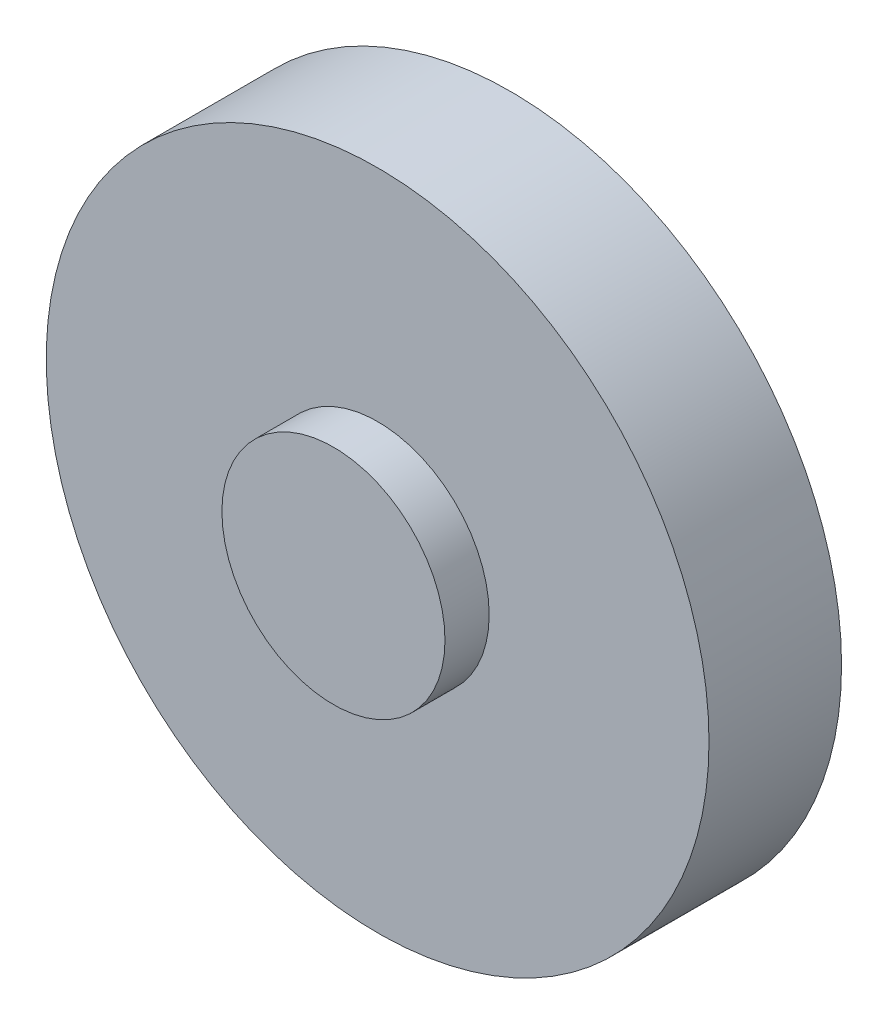
ISO-10303-21;
HEADER;
FILE_DESCRIPTION(('STEP AP214'),'2;1');
FILE_NAME('part.step','',(''),(''),'','','');
FILE_SCHEMA(('AUTOMOTIVE_DESIGN { 1 0 10303 214 1 1 1 1 }'));
ENDSEC;
DATA;
#1=APPLICATION_CONTEXT('core data for automotive mechanical design processes');
#2=APPLICATION_PROTOCOL_DEFINITION('international standard','automotive_design',2000,#1);
#3=PRODUCT_CONTEXT('',#1,'mechanical');
#4=PRODUCT('Part','Part','',(#3));
#5=PRODUCT_RELATED_PRODUCT_CATEGORY('part','',(#4));
#6=PRODUCT_DEFINITION_FORMATION('','',#4);
#7=PRODUCT_DEFINITION_CONTEXT('part definition',#1,'design');
#8=PRODUCT_DEFINITION('design','',#6,#7);
#9=PRODUCT_DEFINITION_SHAPE('','',#8);
#10=(LENGTH_UNIT() NAMED_UNIT(*) SI_UNIT(.MILLI.,.METRE.));
#11=(NAMED_UNIT(*) PLANE_ANGLE_UNIT() SI_UNIT($,.RADIAN.));
#12=(NAMED_UNIT(*) SI_UNIT($,.STERADIAN.) SOLID_ANGLE_UNIT());
#13=UNCERTAINTY_MEASURE_WITH_UNIT(LENGTH_MEASURE(1.E-05),#10,'distance_accuracy_value','');
#14=(GEOMETRIC_REPRESENTATION_CONTEXT(3) GLOBAL_UNCERTAINTY_ASSIGNED_CONTEXT((#13)) GLOBAL_UNIT_ASSIGNED_CONTEXT((#10,
#11,#12)) REPRESENTATION_CONTEXT('',''));
#15=CARTESIAN_POINT('',(0.,0.,0.));
#16=DIRECTION('',(0.,0.,1.));
#17=DIRECTION('',(1.,0.,0.));
#18=AXIS2_PLACEMENT_3D('',#15,#16,#17);
#19=CARTESIAN_POINT('',(0.,0.,60.));
#20=DIRECTION('',(0.,0.,-1.));
#21=DIRECTION('',(-1.,0.,0.));
#22=AXIS2_PLACEMENT_3D('',#19,#20,#21);
#23=CYLINDRICAL_SURFACE('',#22,150.);
#24=CARTESIAN_POINT('',(0.,0.,60.));
#25=DIRECTION('',(0.,0.,1.));
#26=DIRECTION('',(1.,0.,0.));
#27=AXIS2_PLACEMENT_3D('',#24,#25,#26);
#28=CIRCLE('',#27,150.);
#29=CARTESIAN_POINT('',(150.,0.,60.));
#30=VERTEX_POINT('',#29);
#31=EDGE_CURVE('E51',#30,#30,#28,.T.);
#32=ORIENTED_EDGE('',*,*,#31,.F.);
#33=EDGE_LOOP('',(#32));
#34=FACE_BOUND('',#33,.T.);
#35=CARTESIAN_POINT('',(0.,0.,0.));
#36=DIRECTION('',(0.,0.,1.));
#37=DIRECTION('',(1.,0.,0.));
#38=AXIS2_PLACEMENT_3D('',#35,#36,#37);
#39=CIRCLE('',#38,150.);
#40=CARTESIAN_POINT('',(150.,0.,0.));
#41=VERTEX_POINT('',#40);
#42=EDGE_CURVE('E40',#41,#41,#39,.T.);
#43=ORIENTED_EDGE('',*,*,#42,.T.);
#44=EDGE_LOOP('',(#43));
#45=FACE_BOUND('',#44,.T.);
#46=ADVANCED_FACE('F37',(#34,#45),#23,.T.);
#47=CARTESIAN_POINT('',(0.,0.,60.));
#48=DIRECTION('',(0.,0.,1.));
#49=DIRECTION('',(1.,0.,0.));
#50=AXIS2_PLACEMENT_3D('',#47,#48,#49);
#51=PLANE('',#50);
#52=CARTESIAN_POINT('',(0.,0.,60.));
#53=DIRECTION('',(0.,0.,1.));
#54=DIRECTION('',(1.,0.,0.));
#55=AXIS2_PLACEMENT_3D('',#52,#53,#54);
#56=CIRCLE('',#55,50.4922789844958);
#57=CARTESIAN_POINT('',(50.4922789844958,0.,60.));
#58=VERTEX_POINT('',#57);
#59=EDGE_CURVE('E45',#58,#58,#56,.T.);
#60=ORIENTED_EDGE('',*,*,#59,.F.);
#61=EDGE_LOOP('',(#60));
#62=FACE_BOUND('',#61,.T.);
#63=ORIENTED_EDGE('',*,*,#31,.T.);
#64=EDGE_LOOP('',(#63));
#65=FACE_BOUND('',#64,.T.);
#66=ADVANCED_FACE('F71',(#62,#65),#51,.T.);
#67=CARTESIAN_POINT('',(0.,0.,0.));
#68=DIRECTION('',(0.,0.,1.));
#69=DIRECTION('',(1.,0.,0.));
#70=AXIS2_PLACEMENT_3D('',#67,#68,#69);
#71=PLANE('',#70);
#72=CARTESIAN_POINT('',(0.,0.,0.));
#73=DIRECTION('',(0.,0.,-1.));
#74=DIRECTION('',(-1.,0.,0.));
#75=AXIS2_PLACEMENT_3D('',#72,#73,#74);
#76=CIRCLE('',#75,49.3461482612373);
#77=CARTESIAN_POINT('',(-49.3461482612373,0.,0.));
#78=VERTEX_POINT('',#77);
#79=EDGE_CURVE('E10',#78,#78,#76,.T.);
#80=ORIENTED_EDGE('',*,*,#79,.F.);
#81=EDGE_LOOP('',(#80));
#82=FACE_BOUND('',#81,.T.);
#83=ORIENTED_EDGE('',*,*,#42,.F.);
#84=EDGE_LOOP('',(#83));
#85=FACE_BOUND('',#84,.T.);
#86=ADVANCED_FACE('F68',(#82,#85),#71,.F.);
#87=CARTESIAN_POINT('',(0.,0.,80.));
#88=DIRECTION('',(0.,0.,-1.));
#89=DIRECTION('',(-1.,0.,0.));
#90=AXIS2_PLACEMENT_3D('',#87,#88,#89);
#91=CYLINDRICAL_SURFACE('',#90,50.4922789844958);
#92=CARTESIAN_POINT('',(0.,0.,80.));
#93=DIRECTION('',(0.,0.,1.));
#94=DIRECTION('',(1.,0.,0.));
#95=AXIS2_PLACEMENT_3D('',#92,#93,#94);
#96=CIRCLE('',#95,50.4922789844958);
#97=CARTESIAN_POINT('',(50.4922789844958,0.,80.));
#98=VERTEX_POINT('',#97);
#99=EDGE_CURVE('E56',#98,#98,#96,.T.);
#100=ORIENTED_EDGE('',*,*,#99,.F.);
#101=EDGE_LOOP('',(#100));
#102=FACE_BOUND('',#101,.T.);
#103=ORIENTED_EDGE('',*,*,#59,.T.);
#104=EDGE_LOOP('',(#103));
#105=FACE_BOUND('',#104,.T.);
#106=ADVANCED_FACE('F70',(#102,#105),#91,.T.);
#107=CARTESIAN_POINT('',(0.,0.,80.));
#108=DIRECTION('',(0.,0.,1.));
#109=DIRECTION('',(1.,0.,0.));
#110=AXIS2_PLACEMENT_3D('',#107,#108,#109);
#111=PLANE('',#110);
#112=ORIENTED_EDGE('',*,*,#99,.T.);
#113=EDGE_LOOP('',(#112));
#114=FACE_BOUND('',#113,.T.);
#115=ADVANCED_FACE('F77',(#114),#111,.T.);
#116=CARTESIAN_POINT('',(0.,0.,-20.));
#117=DIRECTION('',(0.,0.,1.));
#118=DIRECTION('',(1.,0.,0.));
#119=AXIS2_PLACEMENT_3D('',#116,#117,#118);
#120=CYLINDRICAL_SURFACE('',#119,49.3461482612373);
#121=CARTESIAN_POINT('',(0.,0.,-20.));
#122=DIRECTION('',(0.,0.,-1.));
#123=DIRECTION('',(-1.,0.,0.));
#124=AXIS2_PLACEMENT_3D('',#121,#122,#123);
#125=CIRCLE('',#124,49.3461482612373);
#126=CARTESIAN_POINT('',(-49.3461482612373,0.,-20.));
#127=VERTEX_POINT('',#126);
#128=EDGE_CURVE('E55',#127,#127,#125,.T.);
#129=ORIENTED_EDGE('',*,*,#128,.F.);
#130=EDGE_LOOP('',(#129));
#131=FACE_BOUND('',#130,.T.);
#132=ORIENTED_EDGE('',*,*,#79,.T.);
#133=EDGE_LOOP('',(#132));
#134=FACE_BOUND('',#133,.T.);
#135=ADVANCED_FACE('F105',(#131,#134),#120,.T.);
#136=CARTESIAN_POINT('',(0.,0.,-20.));
#137=DIRECTION('',(0.,0.,-1.));
#138=DIRECTION('',(-1.,0.,0.));
#139=AXIS2_PLACEMENT_3D('',#136,#137,#138);
#140=PLANE('',#139);
#141=ORIENTED_EDGE('',*,*,#128,.T.);
#142=EDGE_LOOP('',(#141));
#143=FACE_BOUND('',#142,.T.);
#144=ADVANCED_FACE('F119',(#143),#140,.T.);
#145=CLOSED_SHELL('',(#46,#66,#86,#106,#115,#135,#144));
#146=MANIFOLD_SOLID_BREP('B2',#145);
#147=ADVANCED_BREP_SHAPE_REPRESENTATION('',(#18,#146),#14);
#148=SHAPE_DEFINITION_REPRESENTATION(#9,#147);
ENDSEC;
END-ISO-10303-21;
